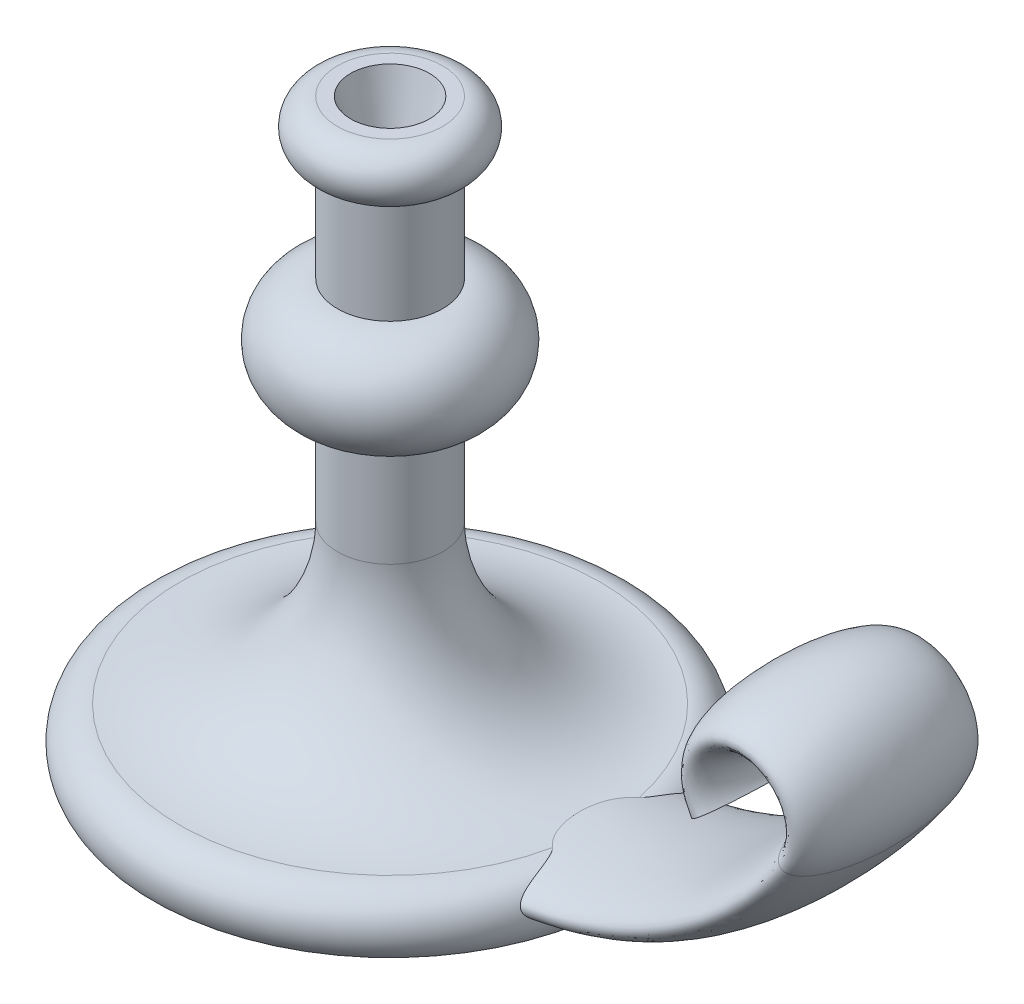
ISO-10303-21;
HEADER;
FILE_DESCRIPTION(('STEP AP214'),'2;1');
FILE_NAME('part.step','',(''),(''),'','','');
FILE_SCHEMA(('AUTOMOTIVE_DESIGN { 1 0 10303 214 1 1 1 1 }'));
ENDSEC;
DATA;
#1=APPLICATION_CONTEXT('core data for automotive mechanical design processes');
#2=APPLICATION_PROTOCOL_DEFINITION('international standard','automotive_design',2000,#1);
#3=PRODUCT_CONTEXT('',#1,'mechanical');
#4=PRODUCT('Part','Part','',(#3));
#5=PRODUCT_RELATED_PRODUCT_CATEGORY('part','',(#4));
#6=PRODUCT_DEFINITION_FORMATION('','',#4);
#7=PRODUCT_DEFINITION_CONTEXT('part definition',#1,'design');
#8=PRODUCT_DEFINITION('design','',#6,#7);
#9=PRODUCT_DEFINITION_SHAPE('','',#8);
#10=(LENGTH_UNIT() NAMED_UNIT(*) SI_UNIT(.MILLI.,.METRE.));
#11=(NAMED_UNIT(*) PLANE_ANGLE_UNIT() SI_UNIT($,.RADIAN.));
#12=(NAMED_UNIT(*) SI_UNIT($,.STERADIAN.) SOLID_ANGLE_UNIT());
#13=UNCERTAINTY_MEASURE_WITH_UNIT(LENGTH_MEASURE(1.E-05),#10,'distance_accuracy_value','');
#14=(GEOMETRIC_REPRESENTATION_CONTEXT(3) GLOBAL_UNCERTAINTY_ASSIGNED_CONTEXT((#13)) GLOBAL_UNIT_ASSIGNED_CONTEXT((#10,
#11,#12)) REPRESENTATION_CONTEXT('',''));
#15=CARTESIAN_POINT('',(0.,0.,0.));
#16=DIRECTION('',(0.,0.,1.));
#17=DIRECTION('',(1.,0.,0.));
#18=AXIS2_PLACEMENT_3D('',#15,#16,#17);
#19=CARTESIAN_POINT('',(0.,0.,0.));
#20=DIRECTION('',(0.,-1.,0.));
#21=DIRECTION('',(0.,0.,-1.));
#22=AXIS2_PLACEMENT_3D('',#19,#20,#21);
#23=PLANE('',#22);
#24=CARTESIAN_POINT('',(0.,0.,0.));
#25=DIRECTION('',(0.,-1.,0.));
#26=DIRECTION('',(0.,0.,-1.));
#27=AXIS2_PLACEMENT_3D('',#24,#25,#26);
#28=CIRCLE('',#27,90.);
#29=CARTESIAN_POINT('',(0.,0.,-90.));
#30=VERTEX_POINT('',#29);
#31=EDGE_CURVE('E66',#30,#30,#28,.T.);
#32=ORIENTED_EDGE('',*,*,#31,.T.);
#33=EDGE_LOOP('',(#32));
#34=FACE_BOUND('',#33,.T.);
#35=ADVANCED_FACE('F40',(#34),#23,.T.);
#36=CARTESIAN_POINT('',(0.,220.,0.));
#37=DIRECTION('',(0.,1.,0.));
#38=DIRECTION('',(0.,0.,1.));
#39=AXIS2_PLACEMENT_3D('',#36,#37,#38);
#40=PLANE('',#39);
#41=CARTESIAN_POINT('',(0.,220.,0.));
#42=DIRECTION('',(0.,1.,0.));
#43=DIRECTION('',(0.,0.,1.));
#44=AXIS2_PLACEMENT_3D('',#41,#42,#43);
#45=CIRCLE('',#44,15.);
#46=CARTESIAN_POINT('',(0.,220.,15.));
#47=VERTEX_POINT('',#46);
#48=EDGE_CURVE('E88',#47,#47,#45,.T.);
#49=ORIENTED_EDGE('',*,*,#48,.F.);
#50=EDGE_LOOP('',(#49));
#51=FACE_BOUND('',#50,.T.);
#52=CARTESIAN_POINT('',(0.,220.,0.));
#53=DIRECTION('',(0.,-1.,0.));
#54=DIRECTION('',(0.,0.,-1.));
#55=AXIS2_PLACEMENT_3D('',#52,#53,#54);
#56=CIRCLE('',#55,20.);
#57=CARTESIAN_POINT('',(0.,220.,-20.));
#58=VERTEX_POINT('',#57);
#59=EDGE_CURVE('E53',#58,#58,#56,.T.);
#60=ORIENTED_EDGE('',*,*,#59,.F.);
#61=EDGE_LOOP('',(#60));
#62=FACE_BOUND('',#61,.T.);
#63=ADVANCED_FACE('F131',(#51,#62),#40,.T.);
#64=CARTESIAN_POINT('',(0.,210.,0.));
#65=DIRECTION('',(0.,-1.,0.));
#66=DIRECTION('',(0.,0.,-1.));
#67=AXIS2_PLACEMENT_3D('',#64,#65,#66);
#68=TOROIDAL_SURFACE('',#67,20.,9.99999999999999);
#69=ORIENTED_EDGE('',*,*,#59,.T.);
#70=EDGE_LOOP('',(#69));
#71=FACE_BOUND('',#70,.T.);
#72=CARTESIAN_POINT('',(0.,200.,0.));
#73=DIRECTION('',(0.,-1.,0.));
#74=DIRECTION('',(0.,0.,-1.));
#75=AXIS2_PLACEMENT_3D('',#72,#73,#74);
#76=CIRCLE('',#75,19.9999999999996);
#77=CARTESIAN_POINT('',(0.,200.,-19.9999999999996));
#78=VERTEX_POINT('',#77);
#79=EDGE_CURVE('E171',#78,#78,#76,.T.);
#80=ORIENTED_EDGE('',*,*,#79,.F.);
#81=EDGE_LOOP('',(#80));
#82=FACE_BOUND('',#81,.T.);
#83=ADVANCED_FACE('F136',(#71,#82),#68,.T.);
#84=CARTESIAN_POINT('',(0.,0.,0.));
#85=DIRECTION('',(0.,-1.,0.));
#86=DIRECTION('',(0.,0.,-1.));
#87=AXIS2_PLACEMENT_3D('',#84,#85,#86);
#88=CYLINDRICAL_SURFACE('',#87,19.9999999999996);
#89=ORIENTED_EDGE('',*,*,#79,.T.);
#90=EDGE_LOOP('',(#89));
#91=FACE_BOUND('',#90,.T.);
#92=CARTESIAN_POINT('',(0.,160.,0.));
#93=DIRECTION('',(0.,-1.,0.));
#94=DIRECTION('',(0.,0.,-1.));
#95=AXIS2_PLACEMENT_3D('',#92,#93,#94);
#96=CIRCLE('',#95,19.9999999999996);
#97=CARTESIAN_POINT('',(0.,160.,-19.9999999999996));
#98=VERTEX_POINT('',#97);
#99=EDGE_CURVE('E166',#98,#98,#96,.T.);
#100=ORIENTED_EDGE('',*,*,#99,.F.);
#101=EDGE_LOOP('',(#100));
#102=FACE_BOUND('',#101,.T.);
#103=ADVANCED_FACE('F143',(#91,#102),#88,.T.);
#104=CARTESIAN_POINT('',(0.,140.,0.));
#105=DIRECTION('',(0.,-1.,0.));
#106=DIRECTION('',(0.,0.,-1.));
#107=AXIS2_PLACEMENT_3D('',#104,#105,#106);
#108=DEGENERATE_TOROIDAL_SURFACE('',#107,19.9999999999996,20.,.T.);
#109=ORIENTED_EDGE('',*,*,#99,.T.);
#110=EDGE_LOOP('',(#109));
#111=FACE_BOUND('',#110,.T.);
#112=CARTESIAN_POINT('',(0.,120.,0.));
#113=DIRECTION('',(0.,-1.,0.));
#114=DIRECTION('',(0.,0.,-1.));
#115=AXIS2_PLACEMENT_3D('',#112,#113,#114);
#116=CIRCLE('',#115,19.9999999999996);
#117=CARTESIAN_POINT('',(0.,120.,-19.9999999999996));
#118=VERTEX_POINT('',#117);
#119=EDGE_CURVE('E162',#118,#118,#116,.T.);
#120=ORIENTED_EDGE('',*,*,#119,.F.);
#121=EDGE_LOOP('',(#120));
#122=FACE_BOUND('',#121,.T.);
#123=ADVANCED_FACE('F151',(#111,#122),#108,.T.);
#124=CARTESIAN_POINT('',(0.,0.,0.));
#125=DIRECTION('',(0.,-1.,0.));
#126=DIRECTION('',(0.,0.,-1.));
#127=AXIS2_PLACEMENT_3D('',#124,#125,#126);
#128=CYLINDRICAL_SURFACE('',#127,19.9999999999996);
#129=ORIENTED_EDGE('',*,*,#119,.T.);
#130=EDGE_LOOP('',(#129));
#131=FACE_BOUND('',#130,.T.);
#132=CARTESIAN_POINT('',(0.,80.,0.));
#133=DIRECTION('',(0.,-1.,0.));
#134=DIRECTION('',(0.,0.,-1.));
#135=AXIS2_PLACEMENT_3D('',#132,#133,#134);
#136=CIRCLE('',#135,19.9999999999996);
#137=CARTESIAN_POINT('',(0.,80.,-19.9999999999996));
#138=VERTEX_POINT('',#137);
#139=EDGE_CURVE('E65',#138,#138,#136,.T.);
#140=ORIENTED_EDGE('',*,*,#139,.F.);
#141=EDGE_LOOP('',(#140));
#142=FACE_BOUND('',#141,.T.);
#143=ADVANCED_FACE('F129',(#131,#142),#128,.T.);
#144=CARTESIAN_POINT('',(0.,80.,0.));
#145=DIRECTION('',(0.,-1.,0.));
#146=DIRECTION('',(0.,0.,-1.));
#147=AXIS2_PLACEMENT_3D('',#144,#145,#146);
#148=TOROIDAL_SURFACE('',#147,79.9999999999996,60.);
#149=CARTESIAN_POINT('',(78.2712666342524,20.,-16.541125096853));
#150=CARTESIAN_POINT('',(78.152521818433,19.9999995602005,-16.4408349085231));
#151=CARTESIAN_POINT('',(78.0353883479743,20.000468719362,-16.3386534718099));
#152=CARTESIAN_POINT('',(77.8044647417479,20.0022893819639,-16.1305896315819));
#153=CARTESIAN_POINT('',(77.690674578722,20.0036408782084,-16.0247072582564));
#154=CARTESIAN_POINT('',(77.354853281745,20.0089279987265,-15.7019707842272));
#155=CARTESIAN_POINT('',(77.1379932168079,20.0140966188975,-15.4797080686229));
#156=CARTESIAN_POINT('',(76.7191150567154,20.0272176108266,-15.0219411688597));
#157=CARTESIAN_POINT('',(76.5170892824195,20.0351685298283,-14.7864439487584));
#158=CARTESIAN_POINT('',(76.1315359067446,20.0531673784301,-14.3073456151809));
#159=CARTESIAN_POINT('',(75.9477545565208,20.0631778343273,-14.0639471128835));
#160=CARTESIAN_POINT('',(75.5950767348687,20.0848631324883,-13.5665721236975));
#161=CARTESIAN_POINT('',(75.4261847587191,20.0965384746351,-13.3125924760846));
#162=CARTESIAN_POINT('',(75.1032588568356,20.1210551086251,-12.7953901749718));
#163=CARTESIAN_POINT('',(74.949226970007,20.1338965599986,-12.5321662598347));
#164=CARTESIAN_POINT('',(74.6193899906028,20.1635459879648,-11.9315826044629));
#165=CARTESIAN_POINT('',(74.4476370778402,20.1805488132033,-11.5920041655326));
#166=CARTESIAN_POINT('',(74.1257989586337,20.2148415370896,-10.9027021260693));
#167=CARTESIAN_POINT('',(73.9757191782407,20.2321315064226,-10.5529760112081));
#168=CARTESIAN_POINT('',(73.695981990494,20.2663193026356,-9.84543684297896));
#169=CARTESIAN_POINT('',(73.5663260490305,20.2832171012942,-9.48762321124751));
#170=CARTESIAN_POINT('',(73.3251432279404,20.3161924913963,-8.76288181392653));
#171=CARTESIAN_POINT('',(73.2137628692611,20.3322628061665,-8.39590522093234));
#172=CARTESIAN_POINT('',(73.0089468727112,20.3629923113056,-7.65700110860843));
#173=CARTESIAN_POINT('',(72.9155086560889,20.3776517043093,-7.28507430898094));
#174=CARTESIAN_POINT('',(72.7452470421549,20.4052178890303,-6.53736778292345));
#175=CARTESIAN_POINT('',(72.6684252383072,20.4181245126183,-6.16158769059031));
#176=CARTESIAN_POINT('',(72.4912488113624,20.4486275160292,-5.19430988782044));
#177=CARTESIAN_POINT('',(72.4020644606577,20.4647624233872,-4.60070161658074));
#178=CARTESIAN_POINT('',(72.2579821332794,20.4914023333564,-3.40903719567007));
#179=CARTESIAN_POINT('',(72.2030999119002,20.5019047485965,-2.81097912959171));
#180=CARTESIAN_POINT('',(72.1254463926361,20.5168990811316,-1.61245432116186));
#181=CARTESIAN_POINT('',(72.1026895725221,20.521388288442,-1.01198661503928));
#182=CARTESIAN_POINT('',(72.0884049814592,20.5241968635403,0.188720705019451));
#183=CARTESIAN_POINT('',(72.0968457218046,20.5225224524743,0.788959937720235));
#184=CARTESIAN_POINT('',(72.1452225152639,20.5130746231111,1.9878588172869));
#185=CARTESIAN_POINT('',(72.1851440489786,20.5053040164763,2.58651906472193));
#186=CARTESIAN_POINT('',(72.2980653787257,20.4839360958841,3.78038866354071));
#187=CARTESIAN_POINT('',(72.3710502726799,20.4703414070646,4.37559944737071));
#188=CARTESIAN_POINT('',(72.5456247937557,20.439170574913,5.51242501211562));
#189=CARTESIAN_POINT('',(72.6444196200247,20.4220059656231,6.05447698891969));
#190=CARTESIAN_POINT('',(72.8755290844281,20.3838764793998,7.13122643006314));
#191=CARTESIAN_POINT('',(73.0078364764085,20.3629124242686,7.66592545795567));
#192=CARTESIAN_POINT('',(73.309481371391,20.3182396975276,8.72344208812382));
#193=CARTESIAN_POINT('',(73.4787345291183,20.2945373344273,9.24628380672671));
#194=CARTESIAN_POINT('',(73.858661903019,20.2457858847496,10.2767177261799));
#195=CARTESIAN_POINT('',(74.0693234998223,20.2207372101511,10.7843145187814));
#196=CARTESIAN_POINT('',(74.4248115689323,20.1830512180627,11.5416326793881));
#197=CARTESIAN_POINT('',(74.5532519799181,20.1701809050413,11.7991056787745));
#198=CARTESIAN_POINT('',(74.8230076152173,20.1449627593431,12.3072679834035));
#199=CARTESIAN_POINT('',(74.964322452186,20.1326149109637,12.5579574924426));
#200=CARTESIAN_POINT('',(75.2601505126401,20.1088190665926,13.0515183920102));
#201=CARTESIAN_POINT('',(75.4146652483654,20.0973711739934,13.2943888823563));
#202=CARTESIAN_POINT('',(75.7367071790644,20.0758077349617,13.7707477089909));
#203=CARTESIAN_POINT('',(75.9042090524094,20.0656896945929,14.0042530195857));
#204=CARTESIAN_POINT('',(76.2523841836197,20.0471875584095,14.4612749125973));
#205=CARTESIAN_POINT('',(76.4330561703653,20.0388032955574,14.6847924556382));
#206=CARTESIAN_POINT('',(76.8071617946219,20.0242012561186,15.1207254884449));
#207=CARTESIAN_POINT('',(77.000587290517,20.0179821129831,15.333147908835));
#208=CARTESIAN_POINT('',(77.370109484358,20.0088519264575,15.7154684562117));
#209=CARTESIAN_POINT('',(77.5445140888511,20.0055867780821,15.8869970727685));
#210=CARTESIAN_POINT('',(77.901705761325,20.0011593433436,16.2209617490862));
#211=CARTESIAN_POINT('',(78.084489178214,19.9999961498132,16.3834017020106));
#212=CARTESIAN_POINT('',(78.2712666342524,20.,16.541125096853));
#213=B_SPLINE_CURVE_WITH_KNOTS('',3,(#149,#150,#151,#152,#153,#154,#155,#156,#157,#158,#159,
#160,#161,#162,#163,#164,#165,#166,#167,#168,#169,#170,#171,#172,#173,#174,#175,#176,#177,#178,
#179,#180,#181,#182,#183,#184,#185,#186,#187,#188,#189,#190,#191,#192,#193,#194,#195,#196,#197,
#198,#199,#200,#201,#202,#203,#204,#205,#206,#207,#208,#209,#210,#211,#212),.UNSPECIFIED.,.F.,
.F.,(4,2,2,2,2,2,2,2,2,2,2,2,2,2,2,2,2,2,2,2,2,2,2,2,2,2,2,2,2,2,2,4),(0.,0.466247546130676,
0.932491289874166,1.86349700812371,2.7940173323237,3.70890497115264,4.62406788619129,
5.5393561897603,6.68127296167187,7.8234751282407,8.96575923732132,10.1167957806283,
11.2676667660641,12.4186480676792,14.2188935636325,16.0199653229957,17.82184850223,
19.6219134794409,21.4211487257717,23.2195738394016,24.8723726255485,26.5248143448489,
28.1735223604637,29.8217287032313,30.6854779204845,31.549201159242,32.4130234830704,
33.2752019938121,34.1372974008855,34.9988476923631,35.732458784417,36.4657531869195),.UNSPECIFIED.);
#214=CARTESIAN_POINT('',(78.2712666342524,20.,-16.5411250968528));
#215=VERTEX_POINT('',#214);
#216=CARTESIAN_POINT('',(78.2712666342524,20.,16.5411250968528));
#217=VERTEX_POINT('',#216);
#218=EDGE_CURVE('E68',#215,#217,#213,.T.);
#219=ORIENTED_EDGE('',*,*,#218,.F.);
#220=CARTESIAN_POINT('',(0.,20.,0.));
#221=DIRECTION('',(0.,-1.,0.));
#222=DIRECTION('',(0.,0.,-1.));
#223=AXIS2_PLACEMENT_3D('',#220,#221,#222);
#224=CIRCLE('',#223,79.9999999999998);
#225=EDGE_CURVE('E59',#217,#215,#224,.T.);
#226=ORIENTED_EDGE('',*,*,#225,.F.);
#227=EDGE_LOOP('',(#219,#226));
#228=FACE_BOUND('',#227,.T.);
#229=ORIENTED_EDGE('',*,*,#139,.T.);
#230=EDGE_LOOP('',(#229));
#231=FACE_BOUND('',#230,.T.);
#232=ADVANCED_FACE('F69',(#228,#231),#148,.F.);
#233=CARTESIAN_POINT('',(0.,7.50000000000001,0.));
#234=DIRECTION('',(0.,-1.,0.));
#235=DIRECTION('',(0.,0.,-1.));
#236=AXIS2_PLACEMENT_3D('',#233,#234,#235);
#237=TOROIDAL_SURFACE('',#236,80.,12.5);
#238=CARTESIAN_POINT('',(78.2712666342524,20.,16.5411250968528));
#239=CARTESIAN_POINT('',(78.3388892558141,19.9999956466091,16.5982789763078));
#240=CARTESIAN_POINT('',(78.4041967419209,19.9992702811947,16.6580526036871));
#241=CARTESIAN_POINT('',(78.5301905551005,19.9965434502476,16.7815005380896));
#242=CARTESIAN_POINT('',(78.5909036085791,19.9945501224221,16.8451476466386));
#243=CARTESIAN_POINT('',(78.7084157352923,19.9894557406181,16.9755868199612));
#244=CARTESIAN_POINT('',(78.7652244379588,19.9863575378188,17.0423704092737));
#245=CARTESIAN_POINT('',(78.8754713552137,19.9791757088205,17.1785504647034));
#246=CARTESIAN_POINT('',(78.9289111406245,19.9750925462289,17.2479456886276));
#247=CARTESIAN_POINT('',(79.0321115032713,19.9661014831887,17.3879176791532));
#248=CARTESIAN_POINT('',(79.0819119096472,19.9612054187805,17.4584659850291));
#249=CARTESIAN_POINT('',(79.1789781802891,19.9506230550508,17.6013445037528));
#250=CARTESIAN_POINT('',(79.2262409589308,19.9449358225776,17.6736767365562));
#251=CARTESIAN_POINT('',(79.3184819734823,19.9328336199171,17.8198159167499));
#252=CARTESIAN_POINT('',(79.3634579992449,19.9264179643642,17.8936241982491));
#253=CARTESIAN_POINT('',(79.4513243361351,19.9129132039229,18.0424380596045));
#254=CARTESIAN_POINT('',(79.4942140010736,19.905823892372,18.1174440009666));
#255=CARTESIAN_POINT('',(79.5969639005972,19.8876863499158,18.3024023173172));
#256=CARTESIAN_POINT('',(79.6557814122332,19.8762915554199,18.4129004302324));
#257=CARTESIAN_POINT('',(79.7699561152128,19.8522807789144,18.6355447229258));
#258=CARTESIAN_POINT('',(79.8253128778172,19.8396646460892,18.7476911047847));
#259=CARTESIAN_POINT('',(79.9868575610246,19.8000993181002,19.0861255774935));
#260=CARTESIAN_POINT('',(80.0885069377538,19.7714355486207,19.314385193763));
#261=CARTESIAN_POINT('',(80.2823234076462,19.7099207472564,19.774529653284));
#262=CARTESIAN_POINT('',(80.37448172355,19.6770659012393,20.0064176277767));
#263=CARTESIAN_POINT('',(80.5510014173372,19.6073961844984,20.4725897597486));
#264=CARTESIAN_POINT('',(80.6353613618323,19.5705805884448,20.7068743489855));
#265=CARTESIAN_POINT('',(80.7988648321052,19.4924779596967,21.1808226178125));
#266=CARTESIAN_POINT('',(80.8779027569697,19.451128583624,21.4205122399646));
#267=CARTESIAN_POINT('',(81.0302064685395,19.3645197093197,21.9007816336788));
#268=CARTESIAN_POINT('',(81.1034770233057,19.3192635072919,22.141360494063));
#269=CARTESIAN_POINT('',(81.2450845901254,19.2247947097312,22.6230858246499));
#270=CARTESIAN_POINT('',(81.3134234622612,19.1755836208218,22.8642320450493));
#271=CARTESIAN_POINT('',(81.4458238857676,19.0731090185489,23.3468072083785));
#272=CARTESIAN_POINT('',(81.5098858231536,19.0198458718354,23.5882361237868));
#273=CARTESIAN_POINT('',(81.6739902059511,18.8737853638837,24.2252806791786));
#274=CARTESIAN_POINT('',(81.7708857569267,18.7774620427732,24.6209063739869));
#275=CARTESIAN_POINT('',(81.9565801857016,18.5727303346962,25.4110697993055));
#276=CARTESIAN_POINT('',(82.0453762866299,18.4643178310933,25.8056071120447));
#277=CARTESIAN_POINT('',(82.2165010773449,18.2341931024825,26.5924524360103));
#278=CARTESIAN_POINT('',(82.2988262672451,18.1124737642143,26.9847591358117));
#279=CARTESIAN_POINT('',(82.4582025946173,17.8546660335245,27.7640097670027));
#280=CARTESIAN_POINT('',(82.5352725062746,17.7186337431694,28.1509683717219));
#281=CARTESIAN_POINT('',(82.6860711061439,17.4297277509145,28.9190701407581));
#282=CARTESIAN_POINT('',(82.7598013253308,17.2768618783952,29.3002159155229));
#283=CARTESIAN_POINT('',(82.869342557822,17.0327243736635,29.8655437914754));
#284=CARTESIAN_POINT('',(82.9056681071524,16.9489039748273,30.0528569335811));
#285=CARTESIAN_POINT('',(82.9782782201632,16.7758098482096,30.4249483690323));
#286=CARTESIAN_POINT('',(83.0145627866396,16.6865365185682,30.6097268462402));
#287=CARTESIAN_POINT('',(83.0878356650454,16.5009497413346,30.9782160348188));
#288=CARTESIAN_POINT('',(83.1248273272166,16.4045696263481,31.1618926140761));
#289=CARTESIAN_POINT('',(83.1995540762813,16.2049209383523,31.5253763426646));
#290=CARTESIAN_POINT('',(83.2372893138772,16.1016509586245,31.7051826918297));
#291=CARTESIAN_POINT('',(83.3140534809661,15.8872824511615,32.0600551683945));
#292=CARTESIAN_POINT('',(83.3530836346581,15.7761763967557,32.235116508484));
#293=CARTESIAN_POINT('',(83.4327849251533,15.5459645279389,32.5777969560037));
#294=CARTESIAN_POINT('',(83.473443341573,15.4269171842875,32.7454580059884));
#295=CARTESIAN_POINT('',(83.5574066404021,15.179074362507,33.0725591680977));
#296=CARTESIAN_POINT('',(83.600709465205,15.0502864453388,33.2320054983609));
#297=CARTESIAN_POINT('',(83.6909243975616,14.7817040010088,33.5399418459578));
#298=CARTESIAN_POINT('',(83.7378303017213,14.6419283820053,33.6884498686622));
#299=CARTESIAN_POINT('',(83.8124496637276,14.4210876358833,33.9019997501039));
#300=CARTESIAN_POINT('',(83.8383724448065,14.3446182702477,33.9724386291871));
#301=CARTESIAN_POINT('',(83.8916881128018,14.1882220784526,34.1088010547365));
#302=CARTESIAN_POINT('',(83.9190809718084,14.1082953179384,34.1747246868722));
#303=CARTESIAN_POINT('',(83.9755475940186,13.9448054085788,34.30130612701));
#304=CARTESIAN_POINT('',(84.0046227760614,13.8612392054281,34.3619593789744));
#305=CARTESIAN_POINT('',(84.0646175310651,13.6905016749764,34.4769964730697));
#306=CARTESIAN_POINT('',(84.0955371541352,13.6033302497495,34.5313801447525));
#307=CARTESIAN_POINT('',(84.159827981082,13.424234579211,34.6335257231648));
#308=CARTESIAN_POINT('',(84.1932276298652,13.3322606137498,34.6811833231731));
#309=CARTESIAN_POINT('',(84.2621790731576,13.145063161087,34.7677396326684));
#310=CARTESIAN_POINT('',(84.2977301667905,13.0498407364993,34.8066411753333));
#311=CARTESIAN_POINT('',(84.370927433163,12.8569010229215,34.8744514195943));
#312=CARTESIAN_POINT('',(84.4085691399321,12.7591892764626,34.9033805380388));
#313=CARTESIAN_POINT('',(84.4858897292474,12.5619624219154,34.9503388268911));
#314=CARTESIAN_POINT('',(84.5255682091112,12.4624476727898,34.968370142924));
#315=CARTESIAN_POINT('',(84.602297037667,12.2735592002774,34.9915485155602));
#316=CARTESIAN_POINT('',(84.6391657268345,12.1842561267288,34.9978808052059));
#317=CARTESIAN_POINT('',(84.7140458891132,12.0059618854177,35.0012194091044));
#318=CARTESIAN_POINT('',(84.7520572593232,11.9169706903709,34.9982265606316));
#319=CARTESIAN_POINT('',(84.8289397514483,11.7400758126391,34.9830935336923));
#320=CARTESIAN_POINT('',(84.8678114880925,11.6521729824251,34.970946595488));
#321=CARTESIAN_POINT('',(84.9460691141164,11.4782475604948,34.9379800584418));
#322=CARTESIAN_POINT('',(84.9854550697216,11.3922252148561,34.9171593316257));
#323=CARTESIAN_POINT('',(85.0697921876541,11.211146284886,34.8641753280263));
#324=CARTESIAN_POINT('',(85.1147749779841,11.1164430562135,34.8308581676945));
#325=CARTESIAN_POINT('',(85.204683844524,10.9306821266821,34.7550998186574));
#326=CARTESIAN_POINT('',(85.2496098599885,10.839626992564,34.7126523352384));
#327=CARTESIAN_POINT('',(85.3391758164203,10.6613482546775,34.6197961730885));
#328=CARTESIAN_POINT('',(85.3838152384228,10.5741304932951,34.5693758577492));
#329=CARTESIAN_POINT('',(85.4725433576215,10.4037423224639,34.4617763413096));
#330=CARTESIAN_POINT('',(85.5166321604844,10.3205711273025,34.4045984597637));
#331=CARTESIAN_POINT('',(85.6333169412857,10.1040418353211,34.2444695603101));
#332=CARTESIAN_POINT('',(85.7053409593996,9.97415412529587,34.1363971219694));
#333=CARTESIAN_POINT('',(85.8473354366547,9.7243672542963,33.9080434887029));
#334=CARTESIAN_POINT('',(85.9173043345895,9.60447556602469,33.787753306584));
#335=CARTESIAN_POINT('',(86.055251411572,9.37343158862613,33.5375399276832));
#336=CARTESIAN_POINT('',(86.1232253856276,9.26229702908971,33.4075981732893));
#337=CARTESIAN_POINT('',(86.2570712449209,9.04801474583276,33.1403753989478));
#338=CARTESIAN_POINT('',(86.3229435933932,8.94486525481447,33.0030960144392));
#339=CARTESIAN_POINT('',(86.476378894114,8.7092046659254,32.6715062554656));
#340=CARTESIAN_POINT('',(86.5630874342161,8.57971108252498,32.4746614819183));
#341=CARTESIAN_POINT('',(86.7330832925728,8.33174351285099,32.0727308970391));
#342=CARTESIAN_POINT('',(86.8163697044967,8.2132724354533,31.8676429306344));
#343=CARTESIAN_POINT('',(86.9796904219888,7.98587185200074,31.4512592814558));
#344=CARTESIAN_POINT('',(87.0597273222956,7.87693464947783,31.2399687933407));
#345=CARTESIAN_POINT('',(87.2168302910934,7.66723280908168,30.8123475780992));
#346=CARTESIAN_POINT('',(87.2938967028469,7.5664672254213,30.5960174380061));
#347=CARTESIAN_POINT('',(87.4378225440236,7.38161755622233,30.1806848657663));
#348=CARTESIAN_POINT('',(87.504941094539,7.29686707614461,29.9820671531158));
#349=CARTESIAN_POINT('',(87.6370407139674,7.13255462477681,29.5819890870837));
#350=CARTESIAN_POINT('',(87.702021650419,7.05299297472361,29.3805285586429));
#351=CARTESIAN_POINT('',(87.8940146299769,6.82117291741662,28.7721902007924));
#352=CARTESIAN_POINT('',(88.0179695510824,6.67591590034942,28.3616675742952));
#353=CARTESIAN_POINT('',(88.2584605699669,6.40072800948788,27.5329675534102));
#354=CARTESIAN_POINT('',(88.3749891793318,6.27081249635212,27.1147829632608));
#355=CARTESIAN_POINT('',(88.6009895197719,6.02410586100464,26.2726296503364));
#356=CARTESIAN_POINT('',(88.7104602849502,5.90731653355023,25.8486601454498));
#357=CARTESIAN_POINT('',(88.9231766254738,5.68459066962672,24.9941437828549));
#358=CARTESIAN_POINT('',(89.0263911874497,5.57870662800874,24.5635756179391));
#359=CARTESIAN_POINT('',(89.2262514874879,5.37709093197067,23.6989379380883));
#360=CARTESIAN_POINT('',(89.3229022580053,5.28135146742117,23.2648713976578));
#361=CARTESIAN_POINT('',(89.5099175972224,5.09885979793831,22.3936656206373));
#362=CARTESIAN_POINT('',(89.600284160349,5.01210473729763,21.9565274078508));
#363=CARTESIAN_POINT('',(89.7749397613502,4.84667344276149,21.0795461515608));
#364=CARTESIAN_POINT('',(89.8592290377239,4.7679968917787,20.6397032149385));
#365=CARTESIAN_POINT('',(90.0784540022272,4.56581507758929,19.4509259683222));
#366=CARTESIAN_POINT('',(90.2078402059694,4.4491904710519,18.6997869704468));
#367=CARTESIAN_POINT('',(90.4501688975161,4.23430719614459,17.1920835371372));
#368=CARTESIAN_POINT('',(90.5631070077506,4.13605341510182,16.4355177133928));
#369=CARTESIAN_POINT('',(90.7729175657154,3.95596611219499,14.9181631267085));
#370=CARTESIAN_POINT('',(90.8697887084949,3.87413392397106,14.1573740259374));
#371=CARTESIAN_POINT('',(91.0476600422184,3.72550404433842,12.6333724812696));
#372=CARTESIAN_POINT('',(91.1286780495739,3.6586894628132,11.870163748772));
#373=CARTESIAN_POINT('',(91.2752034380189,3.53888026147321,10.3412630985617));
#374=CARTESIAN_POINT('',(91.3407124466621,3.4858841914495,9.57557144996886));
#375=CARTESIAN_POINT('',(91.4564034311184,3.39289167700349,8.04224330723818));
#376=CARTESIAN_POINT('',(91.5065851081927,3.3528954859555,7.27460677548737));
#377=CARTESIAN_POINT('',(91.6137884516622,3.2678144139336,5.34025126962954));
#378=CARTESIAN_POINT('',(91.6609082979034,3.23080941709135,4.17260733341162));
#379=CARTESIAN_POINT('',(91.7204104482802,3.18414926197276,1.83556498536136));
#380=CARTESIAN_POINT('',(91.7327821309538,3.17450246626179,0.666166146371143));
#381=CARTESIAN_POINT('',(91.7228215364275,3.18228872563145,-1.67293648505167));
#382=CARTESIAN_POINT('',(91.7004734724547,3.19973409928927,-2.84264017427644));
#383=CARTESIAN_POINT('',(91.6209004051324,3.26229420728158,-5.18084223249578));
#384=CARTESIAN_POINT('',(91.5636538448692,3.30742604374214,-6.34933940898954));
#385=CARTESIAN_POINT('',(91.4140167246999,3.42677596454348,-8.68152701218061));
#386=CARTESIAN_POINT('',(91.3216599843617,3.50096606085112,-9.84522097854721));
#387=CARTESIAN_POINT('',(91.1563678196176,3.6360173499824,-11.5861868730428));
#388=CARTESIAN_POINT('',(91.0968173404284,3.68499011489125,-12.1656955271534));
#389=CARTESIAN_POINT('',(90.9686956054588,3.79133604230013,-13.3229368494866));
#390=CARTESIAN_POINT('',(90.9001246131954,3.8487089594114,-13.9006695690853));
#391=CARTESIAN_POINT('',(90.7539010797045,3.97237503468227,-15.053556700412));
#392=CARTESIAN_POINT('',(90.6762558116217,4.03866105520896,-15.6287127985537));
#393=CARTESIAN_POINT('',(90.5116951221906,4.18090002504314,-16.7764820322327));
#394=CARTESIAN_POINT('',(90.4247800512113,4.25685260900638,-17.3490952630308));
#395=CARTESIAN_POINT('',(90.241566838914,4.41925292328734,-18.490857209683));
#396=CARTESIAN_POINT('',(90.1452762010191,4.50569227428056,-19.0600083149556));
#397=CARTESIAN_POINT('',(89.943029443351,4.69023070761697,-20.1946711952007));
#398=CARTESIAN_POINT('',(89.8370738256628,4.78832918436162,-20.7601831575907));
#399=CARTESIAN_POINT('',(89.6049324425413,5.00730355566552,-21.9389717086917));
#400=CARTESIAN_POINT('',(89.4777819357814,5.12944726939047,-22.5518246264077));
#401=CARTESIAN_POINT('',(89.2110751860417,5.39181482867947,-23.771043613717));
#402=CARTESIAN_POINT('',(89.0715179425478,5.53204013280523,-24.3774091557246));
#403=CARTESIAN_POINT('',(88.8525167674612,5.75832618096298,-25.2799559859267));
#404=CARTESIAN_POINT('',(88.7779794096629,5.83633281295738,-25.5793623583838));
#405=CARTESIAN_POINT('',(88.6255344766268,5.99824881727423,-26.1757059691417));
#406=CARTESIAN_POINT('',(88.5476270421578,6.08215794313974,-26.4726433099578));
#407=CARTESIAN_POINT('',(88.3883274092036,6.25650899481043,-27.063577467753));
#408=CARTESIAN_POINT('',(88.3069360276844,6.34694939245017,-27.3575749543793));
#409=CARTESIAN_POINT('',(88.1404964504877,6.53517055964982,-27.9421520258446));
#410=CARTESIAN_POINT('',(88.0554485100478,6.63295081722232,-28.2327318474482));
#411=CARTESIAN_POINT('',(87.8815058371663,6.83682637014283,-28.8097639467532));
#412=CARTESIAN_POINT('',(87.7926115972512,6.94292060227226,-29.0962167467031));
#413=CARTESIAN_POINT('',(87.6107173984313,7.16467567162325,-29.6641211347925));
#414=CARTESIAN_POINT('',(87.5177171579889,7.2803371653228,-29.9455723781271));
#415=CARTESIAN_POINT('',(87.3272005054348,7.52294157920704,-30.502491192447));
#416=CARTESIAN_POINT('',(87.2296787050351,7.64989813412627,-30.777951018027));
#417=CARTESIAN_POINT('',(87.0298665207673,7.91699416843962,-31.3206199652705));
#418=CARTESIAN_POINT('',(86.9275773439069,8.05713032006172,-31.5878311471567));
#419=CARTESIAN_POINT('',(86.7480037709224,8.31062566519922,-32.0357516544893));
#420=CARTESIAN_POINT('',(86.6720100993225,8.42006072026225,-32.2191943871103));
#421=CARTESIAN_POINT('',(86.5171484093842,8.64829771456511,-32.5790337638854));
#422=CARTESIAN_POINT('',(86.438279647717,8.7671020855274,-32.7554285607943));
#423=CARTESIAN_POINT('',(86.2776918897527,9.01526625916273,-33.0985853512337));
#424=CARTESIAN_POINT('',(86.1959802836637,9.14459971602847,-33.2653697066106));
#425=CARTESIAN_POINT('',(86.0294032792496,9.41581832168086,-33.5866682820311));
#426=CARTESIAN_POINT('',(85.9445404154991,9.55769350467861,-33.7411920624326));
#427=CARTESIAN_POINT('',(85.8138131522041,9.78323424241999,-33.9622058803065));
#428=CARTESIAN_POINT('',(85.7691199178937,9.86153249555666,-34.0348677373873));
#429=CARTESIAN_POINT('',(85.678930912963,10.0222041819633,-34.1749890546521));
#430=CARTESIAN_POINT('',(85.633435020468,10.104578237585,-34.2424477162889));
#431=CARTESIAN_POINT('',(85.4958500686605,10.3581464961975,-34.4355562095092));
#432=CARTESIAN_POINT('',(85.4025439564392,10.5359915959431,-34.5521456229123));
#433=CARTESIAN_POINT('',(85.269559114329,10.7996737708376,-34.6925857046336));
#434=CARTESIAN_POINT('',(85.2304987424107,10.8783498631252,-34.7307425297935));
#435=CARTESIAN_POINT('',(85.1522731182936,11.0385446576321,-34.8003600398788));
#436=CARTESIAN_POINT('',(85.1131079273764,11.1200619376489,-34.8318240205436));
#437=CARTESIAN_POINT('',(85.0349200797612,11.2855844804628,-34.8872431666297));
#438=CARTESIAN_POINT('',(84.9958973213601,11.3695872414405,-34.9112056191379));
#439=CARTESIAN_POINT('',(84.9182225111717,11.5396912627157,-34.9509382938028));
#440=CARTESIAN_POINT('',(84.8795704509195,11.6257924749359,-34.9667087034615));
#441=CARTESIAN_POINT('',(84.8026293496167,11.8001564693124,-34.9895843289462));
#442=CARTESIAN_POINT('',(84.7643457794887,11.8884311068222,-34.9966183715663));
#443=CARTESIAN_POINT('',(84.688781562806,12.0656644370254,-35.0014664065663));
#444=CARTESIAN_POINT('',(84.6515009117251,12.1546231266294,-34.9992804405623));
#445=CARTESIAN_POINT('',(84.5782193926475,12.3323935777475,-34.9856865880054));
#446=CARTESIAN_POINT('',(84.5422189587567,12.4212052798681,-34.9742756039117));
#447=CARTESIAN_POINT('',(84.471736339633,12.5978240434146,-34.9425495638938));
#448=CARTESIAN_POINT('',(84.4372541317249,12.6856311198305,-34.9222346410029));
#449=CARTESIAN_POINT('',(84.3738146764983,12.8495401880201,-34.8761014182713));
#450=CARTESIAN_POINT('',(84.3446776376661,12.9258285989744,-34.851182771427));
#451=CARTESIAN_POINT('',(84.2877340669025,13.0767009841632,-34.79535030801));
#452=CARTESIAN_POINT('',(84.2599279900047,13.1512843709899,-34.7644344590901));
#453=CARTESIAN_POINT('',(84.1785257465426,13.3719836737256,-34.6635625210131));
#454=CARTESIAN_POINT('',(84.1269059556111,13.5151518468402,-34.5854517845417));
#455=CARTESIAN_POINT('',(84.0338718767983,13.7773874749881,-34.4214962686543));
#456=CARTESIAN_POINT('',(83.9919569862763,13.8973915868823,-34.3373844016352));
#457=CARTESIAN_POINT('',(83.9114605781014,14.1302720597576,-34.1582754261092));
#458=CARTESIAN_POINT('',(83.8728814982916,14.2431431919435,-34.0632704728162));
#459=CARTESIAN_POINT('',(83.7984371134358,14.4623431382206,-33.8643728706702));
#460=CARTESIAN_POINT('',(83.7625808160909,14.5686500363469,-33.7604529539109));
#461=CARTESIAN_POINT('',(83.6932130141328,14.7748230841335,-33.5457714872124));
#462=CARTESIAN_POINT('',(83.6597009944698,14.8746906481685,-33.4350114502149));
#463=CARTESIAN_POINT('',(83.5720737063467,15.1354622076479,-33.1296793792285));
#464=CARTESIAN_POINT('',(83.5196901207736,15.2909557959872,-32.9299906787083));
#465=CARTESIAN_POINT('',(83.4184271933151,15.5879032778501,-32.5192921244142));
#466=CARTESIAN_POINT('',(83.3695532962386,15.7293354823561,-32.3082655316523));
#467=CARTESIAN_POINT('',(83.2740150847558,16.0001008031089,-31.877934117383));
#468=CARTESIAN_POINT('',(83.2273524189431,16.1294249601141,-31.6586233318497));
#469=CARTESIAN_POINT('',(83.1350217384172,16.3781419623112,-31.2127839021022));
#470=CARTESIAN_POINT('',(83.0893599129,16.497481538844,-30.9862244820197));
#471=CARTESIAN_POINT('',(82.9985093129937,16.7267386175829,-30.5285934080004));
#472=CARTESIAN_POINT('',(82.953320133928,16.8366648795277,-30.2975262002814));
#473=CARTESIAN_POINT('',(82.8627395348091,17.0482595052774,-29.8317799321949));
#474=CARTESIAN_POINT('',(82.8173481770894,17.1499302504421,-29.597101936784));
#475=CARTESIAN_POINT('',(82.7223694680817,17.3532902217553,-29.1070665122084));
#476=CARTESIAN_POINT('',(82.6727235102004,17.4544044810009,-28.8514824483902));
#477=CARTESIAN_POINT('',(82.5719932470259,17.6489922805873,-28.3376892073361));
#478=CARTESIAN_POINT('',(82.5209088280907,17.7424652149546,-28.0794798237288));
#479=CARTESIAN_POINT('',(82.4167546707964,17.9225399441047,-27.5608047978419));
#480=CARTESIAN_POINT('',(82.3636831771265,18.0091354423275,-27.300337324716));
#481=CARTESIAN_POINT('',(82.2551248640053,18.1759238059506,-26.7778584219037));
#482=CARTESIAN_POINT('',(82.1996379286197,18.2561163635034,-26.5158469186313));
#483=CARTESIAN_POINT('',(82.0287444819279,18.4879830445323,-25.7275251902792));
#484=CARTESIAN_POINT('',(81.9090155015089,18.6307544051939,-25.1994881186978));
#485=CARTESIAN_POINT('',(81.717886919796,18.8290650587713,-24.4065351192847));
#486=CARTESIAN_POINT('',(81.6522771425217,18.8925102186889,-24.1421505189681));
#487=CARTESIAN_POINT('',(81.5166076741806,19.0143635542631,-23.6133651939154));
#488=CARTESIAN_POINT('',(81.446548200288,19.0727719754178,-23.3489644705946));
#489=CARTESIAN_POINT('',(81.3013654110012,19.1846745672405,-22.820804678202));
#490=CARTESIAN_POINT('',(81.2262471637335,19.2381735330948,-22.5570452333455));
#491=CARTESIAN_POINT('',(81.0700468636977,19.3404252807406,-22.030385406888));
#492=CARTESIAN_POINT('',(80.9889652270802,19.3891783931673,-21.7674849666766));
#493=CARTESIAN_POINT('',(80.8198637173419,19.4819159482426,-21.2434494703455));
#494=CARTESIAN_POINT('',(80.7318528008308,19.525906377747,-20.9823125940285));
#495=CARTESIAN_POINT('',(80.5473975921768,19.6091248541439,-20.4622889134516));
#496=CARTESIAN_POINT('',(80.450954869705,19.6483537842069,-20.2034017002166));
#497=CARTESIAN_POINT('',(80.2946063541235,19.7048758025027,-19.8078680279796));
#498=CARTESIAN_POINT('',(80.2384058452441,19.7239300086273,-19.6700047637551));
#499=CARTESIAN_POINT('',(80.1225595816581,19.760550918102,-19.3955133448287));
#500=CARTESIAN_POINT('',(80.0629135392958,19.7781174969524,-19.2588852943548));
#501=CARTESIAN_POINT('',(79.9396627800554,19.8116903475295,-18.9871768909477));
#502=CARTESIAN_POINT('',(79.8760569064615,19.8276961597995,-18.8520970040259));
#503=CARTESIAN_POINT('',(79.744841667487,19.8579028062674,-18.5851486303858));
#504=CARTESIAN_POINT('',(79.677271857252,19.8721181055308,-18.4532624438171));
#505=CARTESIAN_POINT('',(79.5368706994965,19.8987552846798,-18.1921539854828));
#506=CARTESIAN_POINT('',(79.4640403012987,19.9111774869395,-18.0629312384574));
#507=CARTESIAN_POINT('',(79.3121236956787,19.9340252817181,-17.8080304783976));
#508=CARTESIAN_POINT('',(79.2330390144744,19.9444513592352,-17.6823516106515));
#509=CARTESIAN_POINT('',(79.1086379396101,19.9583865103848,-17.4973179690556));
#510=CARTESIAN_POINT('',(79.0661382217622,19.9627530037611,-17.4361287743569));
#511=CARTESIAN_POINT('',(78.9790570420628,19.970859452056,-17.315232430105));
#512=CARTESIAN_POINT('',(78.9344762864846,19.9745996175925,-17.2555247881208));
#513=CARTESIAN_POINT('',(78.8430399487578,19.9813955490244,-17.1378979454018));
#514=CARTESIAN_POINT('',(78.7961859715083,19.9844517894573,-17.0799775288178));
#515=CARTESIAN_POINT('',(78.6994379587569,19.9898425833392,-16.9656484478171));
#516=CARTESIAN_POINT('',(78.6495173102813,19.9921692762932,-16.9092618547058));
#517=CARTESIAN_POINT('',(78.546791050711,19.9959759371906,-16.7990552317829));
#518=CARTESIAN_POINT('',(78.4939834218412,19.9974553044124,-16.7452370475931));
#519=CARTESIAN_POINT('',(78.3851077252362,19.9994675838941,-16.6406716194521));
#520=CARTESIAN_POINT('',(78.3290306694248,19.9999977464548,-16.5899337074093));
#521=CARTESIAN_POINT('',(78.2712666342525,20.,-16.5411250968528));
#522=B_SPLINE_CURVE_WITH_KNOTS('',3,(#238,#239,#240,#241,#242,#243,#244,#245,#246,#247,#248,
#249,#250,#251,#252,#253,#254,#255,#256,#257,#258,#259,#260,#261,#262,#263,#264,#265,#266,#267,
#268,#269,#270,#271,#272,#273,#274,#275,#276,#277,#278,#279,#280,#281,#282,#283,#284,#285,#286,
#287,#288,#289,#290,#291,#292,#293,#294,#295,#296,#297,#298,#299,#300,#301,#302,#303,#304,#305,
#306,#307,#308,#309,#310,#311,#312,#313,#314,#315,#316,#317,#318,#319,#320,#321,#322,#323,#324,
#325,#326,#327,#328,#329,#330,#331,#332,#333,#334,#335,#336,#337,#338,#339,#340,#341,#342,#343,
#344,#345,#346,#347,#348,#349,#350,#351,#352,#353,#354,#355,#356,#357,#358,#359,#360,#361,#362,
#363,#364,#365,#366,#367,#368,#369,#370,#371,#372,#373,#374,#375,#376,#377,#378,#379,#380,#381,
#382,#383,#384,#385,#386,#387,#388,#389,#390,#391,#392,#393,#394,#395,#396,#397,#398,#399,#400,
#401,#402,#403,#404,#405,#406,#407,#408,#409,#410,#411,#412,#413,#414,#415,#416,#417,#418,#419,
#420,#421,#422,#423,#424,#425,#426,#427,#428,#429,#430,#431,#432,#433,#434,#435,#436,#437,#438,
#439,#440,#441,#442,#443,#444,#445,#446,#447,#448,#449,#450,#451,#452,#453,#454,#455,#456,#457,
#458,#459,#460,#461,#462,#463,#464,#465,#466,#467,#468,#469,#470,#471,#472,#473,#474,#475,#476,
#477,#478,#479,#480,#481,#482,#483,#484,#485,#486,#487,#488,#489,#490,#491,#492,#493,#494,#495,
#496,#497,#498,#499,#500,#501,#502,#503,#504,#505,#506,#507,#508,#509,#510,#511,#512,#513,#514,
#515,#516,#517,#518,#519,#520,#521),.UNSPECIFIED.,.F.,.F.,(4,2,2,2,2,2,2,2,2,2,2,2,2,2,2,2,2,2,
2,2,2,2,2,2,2,2,2,2,2,2,2,2,2,2,2,2,2,2,2,2,2,2,2,2,2,2,2,2,2,2,2,2,2,2,2,2,2,2,2,2,2,2,2,2,2,2,
2,2,2,2,2,2,2,2,2,2,2,2,2,2,2,2,2,2,2,2,2,2,2,2,2,2,2,2,2,2,2,2,2,2,2,2,2,2,2,2,2,2,2,2,2,2,2,2,
2,2,2,2,2,2,2,2,2,2,2,2,2,2,2,2,2,2,2,2,2,2,2,2,2,2,2,4),(0.,0.265437731793688,
0.529188855373207,0.792264224757996,1.05521600884612,1.31462977977625,1.57435215499723,
1.83432095765815,2.09436977197604,2.47137225494381,2.84842135117218,3.60260099941451,
4.35747195968054,5.11248139508549,5.87962264534274,6.6461228657408,7.41233245776534,
8.17847280165927,9.43385283168144,10.6896616596242,11.9461451019839,13.1978751032536,
14.4490253583368,15.0741636567049,15.6992563657013,16.331228563776,16.9633301902002,
17.5960474533305,18.2245331925272,18.8525359903636,19.4794808031506,19.800801522533,
20.1221161436895,20.4437058213687,20.7653042398888,21.0914422359263,21.4174745520296,
21.7428353517008,22.0681320714922,22.3581500476234,22.6481419847178,22.938348273281,
23.2285923132214,23.5581258315192,23.8878872723189,24.2181345302993,24.5483174069024,
25.0984226776884,25.6489355694018,26.2005358211597,26.7520136386917,27.5046897085626,
28.2575638520475,29.0098245014493,29.7619979592038,30.4403026934102,31.118649381208,
32.4764125471866,33.8355238474494,35.1948207549471,36.5603819093564,37.9248839847093,
39.2889510110504,40.6529644762956,42.965682769472,45.2790154595412,47.5925359453913,
49.9034412764756,52.2141039876767,54.5248117321809,58.0314412726244,61.5391425670064,
65.0484392501377,68.5599058367153,72.0679985696871,73.8217362689412,75.5754227474941,
77.3277131420296,79.0799373290398,80.8307705314629,82.5815128317861,84.4942984218496,
86.4072384044802,87.361931394183,88.3165845445885,89.2710150476083,90.2253790366719,
91.1796211770597,92.1339288492022,93.0894045548709,94.0446396528453,94.7245467110329,
95.4046308174851,96.0830626506392,96.7609601589123,97.1081545580757,97.4554021364385,
98.1489578845037,98.436051905529,98.7230042246583,99.0096769231552,99.2963430599072,
99.5853295997173,99.8743148351409,100.163397145233,100.452475136309,100.708363160329,
100.964338052303,101.475947411675,101.932583056374,102.389549643012,102.847967494727,
103.306284311299,104.080711930278,104.856316115141,105.632489739274,106.412570428791,
107.191917126875,107.97103821254,108.808820810842,109.646669782769,110.485277201034,
111.323924914515,113.003025857147,113.842052915366,114.681039055012,115.51919681452,
116.357296139213,117.194329403436,118.031207175386,118.481443833064,118.93171813391,
119.382124588291,119.828620402027,120.27503584172,120.721342677886,120.945190845322,
121.168963586641,121.392580579821,121.618530133654,121.844639679442,122.071403176285),.UNSPECIFIED.);
#523=EDGE_CURVE('E11',#217,#215,#522,.T.);
#524=ORIENTED_EDGE('',*,*,#523,.F.);
#525=ORIENTED_EDGE('',*,*,#225,.T.);
#526=EDGE_LOOP('',(#524,#525));
#527=FACE_BOUND('',#526,.T.);
#528=ORIENTED_EDGE('',*,*,#31,.F.);
#529=EDGE_LOOP('',(#528));
#530=FACE_BOUND('',#529,.T.);
#531=ADVANCED_FACE('F61',(#527,#530),#237,.T.);
#532=CARTESIAN_POINT('',(150.634185358261,75.,0.));
#533=DIRECTION('',(0.566666666666667,-0.823947139620551,0.));
#534=DIRECTION('',(0.,0.,-1.));
#535=AXIS2_PLACEMENT_3D('',#532,#533,#534);
#536=PLANE('',#535);
#537=CARTESIAN_POINT('',(150.634185358261,75.,0.));
#538=DIRECTION('',(0.566666666666667,-0.823947139620551,0.));
#539=DIRECTION('',(0.,0.,-1.));
#540=AXIS2_PLACEMENT_3D('',#537,#538,#539);
#541=ELLIPSE('',#540,35.,10.);
#542=CARTESIAN_POINT('',(150.634185358261,75.,-35.));
#543=VERTEX_POINT('',#542);
#544=EDGE_CURVE('E72',#543,#543,#541,.T.);
#545=ORIENTED_EDGE('',*,*,#544,.T.);
#546=EDGE_LOOP('',(#545));
#547=FACE_BOUND('',#546,.T.);
#548=ADVANCED_FACE('F78',(#547),#536,.T.);
#549=CARTESIAN_POINT('',(60.,10.,-35.));
#550=CARTESIAN_POINT('',(110.410191303973,10.,-35.));
#551=CARTESIAN_POINT('',(155.026295870831,33.4646670673665,-35.));
#552=CARTESIAN_POINT('',(183.592070943083,75.,-35.));
#553=CARTESIAN_POINT('',(60.,30.,-35.));
#554=CARTESIAN_POINT('',(103.688832463443,30.,-35.));
#555=CARTESIAN_POINT('',(142.356123088054,50.3360447917176,-35.));
#556=CARTESIAN_POINT('',(167.113128150672,86.3333333333333,-35.));
#557=CARTESIAN_POINT('',(60.,30.,35.));
#558=CARTESIAN_POINT('',(103.688832463443,30.,35.));
#559=CARTESIAN_POINT('',(142.356123088054,50.3360447917176,35.));
#560=CARTESIAN_POINT('',(167.113128150672,86.3333333333333,35.));
#561=CARTESIAN_POINT('',(60.,10.,35.));
#562=CARTESIAN_POINT('',(110.410191303973,10.,35.));
#563=CARTESIAN_POINT('',(155.026295870831,33.4646670673665,35.));
#564=CARTESIAN_POINT('',(183.592070943083,75.,35.));
#565=CARTESIAN_POINT('',(60.,-10.,35.));
#566=CARTESIAN_POINT('',(117.131550144503,-10.,35.));
#567=CARTESIAN_POINT('',(167.696468653609,16.5932893430153,35.));
#568=CARTESIAN_POINT('',(200.071013735494,63.6666666666666,35.));
#569=CARTESIAN_POINT('',(60.,-10.,-35.));
#570=CARTESIAN_POINT('',(117.131550144503,-10.,-35.));
#571=CARTESIAN_POINT('',(167.696468653609,16.5932893430153,-35.));
#572=CARTESIAN_POINT('',(200.071013735494,63.6666666666666,-35.));
#573=CARTESIAN_POINT('',(60.,10.,-35.));
#574=CARTESIAN_POINT('',(110.410191303973,10.,-35.));
#575=CARTESIAN_POINT('',(155.026295870831,33.4646670673665,-35.));
#576=CARTESIAN_POINT('',(183.592070943083,75.,-35.));
#577=(BOUNDED_SURFACE() B_SPLINE_SURFACE(3,3,((#549,#550,#551,#552),(#553,#554,#555,#556),(#557,
#558,#559,#560),(#561,#562,#563,#564),(#565,#566,#567,#568),(#569,#570,#571,#572),(#573,#574,
#575,#576)),.UNSPECIFIED.,.T.,.F.,.F.) B_SPLINE_SURFACE_WITH_KNOTS((4,3,4),(4,4),(0.,0.5,1.),
(0.,1.),.UNSPECIFIED.) GEOMETRIC_REPRESENTATION_ITEM() RATIONAL_B_SPLINE_SURFACE(((1.,
0.923374135437856,0.923374135437856,1.),(0.333333333333333,0.307791378479285,0.307791378479285,
0.333333333333333),(0.333333333333333,0.307791378479285,0.307791378479285,0.333333333333333),
(1.,0.923374135437856,0.923374135437856,1.),(0.333333333333333,0.307791378479285,
0.307791378479285,0.333333333333333),(0.333333333333333,0.307791378479285,0.307791378479285,
0.333333333333333),(1.,0.923374135437856,0.923374135437856,1.))) REPRESENTATION_ITEM('') SURFACE());
#578=CARTESIAN_POINT('',(183.592070943083,75.,0.));
#579=DIRECTION('',(0.566666666666667,0.823947139620552,0.));
#580=DIRECTION('',(0.,0.,-1.));
#581=AXIS2_PLACEMENT_3D('',#578,#579,#580);
#582=ELLIPSE('',#581,35.,10.);
#583=CARTESIAN_POINT('',(183.592070943083,75.,-35.));
#584=VERTEX_POINT('',#583);
#585=EDGE_CURVE('E81',#584,#584,#582,.T.);
#586=ORIENTED_EDGE('',*,*,#523,.T.);
#587=ORIENTED_EDGE('',*,*,#218,.T.);
#588=EDGE_LOOP('',(#586,#587));
#589=FACE_BOUND('',#588,.T.);
#590=ORIENTED_EDGE('',*,*,#585,.F.);
#591=EDGE_LOOP('',(#590));
#592=FACE_BOUND('',#591,.T.);
#593=ADVANCED_FACE('F74',(#589,#592),#577,.T.);
#594=CARTESIAN_POINT('',(183.592070943083,75.,-35.));
#595=CARTESIAN_POINT('',(193.981461744242,90.10642735238,-35.));
#596=CARTESIAN_POINT('',(185.447347211541,106.333333333333,-35.));
#597=CARTESIAN_POINT('',(167.113128150672,106.333333333333,-35.));
#598=CARTESIAN_POINT('',(148.778909089802,106.333333333333,-35.));
#599=CARTESIAN_POINT('',(140.244794557101,90.1064273523801,-35.));
#600=CARTESIAN_POINT('',(150.634185358261,75.,-35.));
#601=CARTESIAN_POINT('',(167.113128150672,86.3333333333334,-35.));
#602=CARTESIAN_POINT('',(167.113128150672,86.3333333333333,-35.));
#603=CARTESIAN_POINT('',(167.113128150672,86.3333333333333,-35.));
#604=CARTESIAN_POINT('',(167.113128150672,86.3333333333333,-35.));
#605=CARTESIAN_POINT('',(167.113128150672,86.3333333333334,-35.));
#606=CARTESIAN_POINT('',(167.113128150672,86.3333333333334,-35.));
#607=CARTESIAN_POINT('',(167.113128150672,86.3333333333334,-35.));
#608=CARTESIAN_POINT('',(167.113128150672,86.3333333333334,35.));
#609=CARTESIAN_POINT('',(167.113128150672,86.3333333333333,35.));
#610=CARTESIAN_POINT('',(167.113128150672,86.3333333333332,35.));
#611=CARTESIAN_POINT('',(167.113128150672,86.3333333333333,35.));
#612=CARTESIAN_POINT('',(167.113128150672,86.3333333333334,35.));
#613=CARTESIAN_POINT('',(167.113128150672,86.3333333333334,35.));
#614=CARTESIAN_POINT('',(167.113128150672,86.3333333333334,35.));
#615=CARTESIAN_POINT('',(183.592070943083,75.,35.));
#616=CARTESIAN_POINT('',(193.981461744242,90.10642735238,35.));
#617=CARTESIAN_POINT('',(185.447347211541,106.333333333333,35.));
#618=CARTESIAN_POINT('',(167.113128150672,106.333333333333,35.));
#619=CARTESIAN_POINT('',(148.778909089802,106.333333333333,35.));
#620=CARTESIAN_POINT('',(140.244794557101,90.1064273523801,35.));
#621=CARTESIAN_POINT('',(150.634185358261,75.,35.));
#622=CARTESIAN_POINT('',(200.071013735494,63.6666666666665,35.));
#623=CARTESIAN_POINT('',(220.849795337813,93.8795213714266,35.));
#624=CARTESIAN_POINT('',(203.781566272411,126.333333333333,35.));
#625=CARTESIAN_POINT('',(167.113128150672,126.333333333333,35.));
#626=CARTESIAN_POINT('',(130.444690028933,126.333333333333,35.));
#627=CARTESIAN_POINT('',(113.376460963531,93.8795213714269,35.));
#628=CARTESIAN_POINT('',(134.15524256585,63.6666666666667,35.));
#629=CARTESIAN_POINT('',(200.071013735494,63.6666666666665,-35.));
#630=CARTESIAN_POINT('',(220.849795337813,93.8795213714266,-35.));
#631=CARTESIAN_POINT('',(203.781566272411,126.333333333333,-35.));
#632=CARTESIAN_POINT('',(167.113128150672,126.333333333333,-35.));
#633=CARTESIAN_POINT('',(130.444690028933,126.333333333333,-35.));
#634=CARTESIAN_POINT('',(113.376460963531,93.8795213714269,-35.));
#635=CARTESIAN_POINT('',(134.15524256585,63.6666666666667,-35.));
#636=CARTESIAN_POINT('',(183.592070943083,75.,-35.));
#637=CARTESIAN_POINT('',(193.981461744242,90.10642735238,-35.));
#638=CARTESIAN_POINT('',(185.447347211541,106.333333333333,-35.));
#639=CARTESIAN_POINT('',(167.113128150672,106.333333333333,-35.));
#640=CARTESIAN_POINT('',(148.778909089802,106.333333333333,-35.));
#641=CARTESIAN_POINT('',(140.244794557101,90.1064273523801,-35.));
#642=CARTESIAN_POINT('',(150.634185358261,75.,-35.));
#643=(BOUNDED_SURFACE() B_SPLINE_SURFACE(3,3,((#594,#595,#596,#597,#598,#599,#600),(#601,#602,
#603,#604,#605,#606,#607),(#608,#609,#610,#611,#612,#613,#614),(#615,#616,#617,#618,#619,#620,
#621),(#622,#623,#624,#625,#626,#627,#628),(#629,#630,#631,#632,#633,#634,#635),(#636,#637,#638,
#639,#640,#641,#642)),.UNSPECIFIED.,.T.,.F.,.F.) B_SPLINE_SURFACE_WITH_KNOTS((4,3,4),(4,3,4),
(0.,0.5,1.),(0.,0.5,1.),
.UNSPECIFIED.) GEOMETRIC_REPRESENTATION_ITEM() RATIONAL_B_SPLINE_SURFACE(((1.,0.64364977875042,
0.64364977875042,1.,0.64364977875042,0.64364977875042,1.),(0.333333333333333,0.21454992625014,
0.21454992625014,0.333333333333333,0.21454992625014,0.21454992625014,0.333333333333333),
(0.333333333333333,0.21454992625014,0.21454992625014,0.333333333333333,0.21454992625014,
0.21454992625014,0.333333333333333),(1.,0.64364977875042,0.64364977875042,1.,0.64364977875042,
0.64364977875042,1.),(0.333333333333333,0.21454992625014,0.21454992625014,0.333333333333333,
0.21454992625014,0.21454992625014,0.333333333333333),(0.333333333333333,0.21454992625014,
0.21454992625014,0.333333333333333,0.21454992625014,0.21454992625014,0.333333333333333),(1.,
0.64364977875042,0.64364977875042,1.,0.64364977875042,0.64364977875042,1.))) REPRESENTATION_ITEM('') SURFACE());
#644=ORIENTED_EDGE('',*,*,#544,.F.);
#645=EDGE_LOOP('',(#644));
#646=FACE_BOUND('',#645,.T.);
#647=ORIENTED_EDGE('',*,*,#585,.T.);
#648=EDGE_LOOP('',(#647));
#649=FACE_BOUND('',#648,.T.);
#650=ADVANCED_FACE('F77',(#646,#649),#643,.T.);
#651=CARTESIAN_POINT('',(0.,220.,0.));
#652=DIRECTION('',(0.,1.,0.));
#653=DIRECTION('',(0.,0.,1.));
#654=AXIS2_PLACEMENT_3D('',#651,#652,#653);
#655=CONICAL_SURFACE('',#654,15.,0.26179938779915);
#656=CARTESIAN_POINT('',(0.,195.,0.));
#657=DIRECTION('',(0.,1.,0.));
#658=DIRECTION('',(0.,0.,1.));
#659=AXIS2_PLACEMENT_3D('',#656,#657,#658);
#660=CIRCLE('',#659,8.30127018922192);
#661=CARTESIAN_POINT('',(0.,195.,8.30127018922192));
#662=VERTEX_POINT('',#661);
#663=EDGE_CURVE('E83',#662,#662,#660,.T.);
#664=ORIENTED_EDGE('',*,*,#663,.F.);
#665=EDGE_LOOP('',(#664));
#666=FACE_BOUND('',#665,.T.);
#667=ORIENTED_EDGE('',*,*,#48,.T.);
#668=EDGE_LOOP('',(#667));
#669=FACE_BOUND('',#668,.T.);
#670=ADVANCED_FACE('F104',(#666,#669),#655,.F.);
#671=CARTESIAN_POINT('',(0.,195.,0.));
#672=DIRECTION('',(0.,1.,0.));
#673=DIRECTION('',(0.,0.,1.));
#674=AXIS2_PLACEMENT_3D('',#671,#672,#673);
#675=PLANE('',#674);
#676=ORIENTED_EDGE('',*,*,#663,.T.);
#677=EDGE_LOOP('',(#676));
#678=FACE_BOUND('',#677,.T.);
#679=ADVANCED_FACE('F224',(#678),#675,.T.);
#680=CLOSED_SHELL('',(#35,#63,#83,#103,#123,#143,#232,#531,#548,#593,#650,#670,#679));
#681=MANIFOLD_SOLID_BREP('B2',#680);
#682=ADVANCED_BREP_SHAPE_REPRESENTATION('',(#18,#681),#14);
#683=SHAPE_DEFINITION_REPRESENTATION(#9,#682);
ENDSEC;
END-ISO-10303-21;
